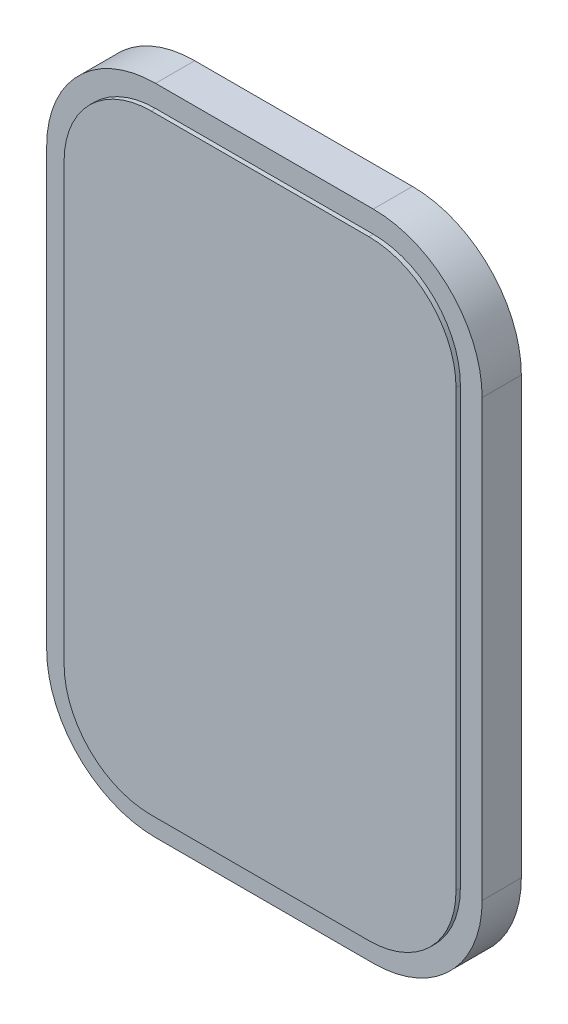
ISO-10303-21;
HEADER;
FILE_DESCRIPTION(('STEP AP214'),'2;1');
FILE_NAME('part.step','',(''),(''),'','','');
FILE_SCHEMA(('AUTOMOTIVE_DESIGN { 1 0 10303 214 1 1 1 1 }'));
ENDSEC;
DATA;
#1=APPLICATION_CONTEXT('core data for automotive mechanical design processes');
#2=APPLICATION_PROTOCOL_DEFINITION('international standard','automotive_design',2000,#1);
#3=PRODUCT_CONTEXT('',#1,'mechanical');
#4=PRODUCT('Part','Part','',(#3));
#5=PRODUCT_RELATED_PRODUCT_CATEGORY('part','',(#4));
#6=PRODUCT_DEFINITION_FORMATION('','',#4);
#7=PRODUCT_DEFINITION_CONTEXT('part definition',#1,'design');
#8=PRODUCT_DEFINITION('design','',#6,#7);
#9=PRODUCT_DEFINITION_SHAPE('','',#8);
#10=(LENGTH_UNIT() NAMED_UNIT(*) SI_UNIT(.MILLI.,.METRE.));
#11=(NAMED_UNIT(*) PLANE_ANGLE_UNIT() SI_UNIT($,.RADIAN.));
#12=(NAMED_UNIT(*) SI_UNIT($,.STERADIAN.) SOLID_ANGLE_UNIT());
#13=UNCERTAINTY_MEASURE_WITH_UNIT(LENGTH_MEASURE(1.E-05),#10,'distance_accuracy_value','');
#14=(GEOMETRIC_REPRESENTATION_CONTEXT(3) GLOBAL_UNCERTAINTY_ASSIGNED_CONTEXT((#13)) GLOBAL_UNIT_ASSIGNED_CONTEXT((#10,
#11,#12)) REPRESENTATION_CONTEXT('',''));
#15=CARTESIAN_POINT('',(0.,0.,0.));
#16=DIRECTION('',(0.,0.,1.));
#17=DIRECTION('',(1.,0.,0.));
#18=AXIS2_PLACEMENT_3D('',#15,#16,#17);
#19=CARTESIAN_POINT('',(12.7,-19.05,2.54));
#20=DIRECTION('',(-1.,0.,0.));
#21=DIRECTION('',(0.,0.,1.));
#22=AXIS2_PLACEMENT_3D('',#19,#20,#21);
#23=PLANE('',#22);
#24=DIRECTION('',(0.,1.,0.));
#25=VECTOR('',#24,1.);
#26=CARTESIAN_POINT('',(12.7,-12.7,2.286));
#27=LINE('',#26,#25);
#28=CARTESIAN_POINT('',(12.7,-12.7,2.286));
#29=VERTEX_POINT('',#28);
#30=CARTESIAN_POINT('',(12.7,12.7,2.286));
#31=VERTEX_POINT('',#30);
#32=EDGE_CURVE('E225',#29,#31,#27,.T.);
#33=ORIENTED_EDGE('',*,*,#32,.F.);
#34=DIRECTION('',(0.,0.,-1.));
#35=VECTOR('',#34,1.);
#36=CARTESIAN_POINT('',(12.7,-12.7,2.54));
#37=LINE('',#36,#35);
#38=CARTESIAN_POINT('',(12.7,-12.7,0.));
#39=VERTEX_POINT('',#38);
#40=EDGE_CURVE('E249',#29,#39,#37,.T.);
#41=ORIENTED_EDGE('',*,*,#40,.T.);
#42=DIRECTION('',(0.,1.,0.));
#43=VECTOR('',#42,1.);
#44=CARTESIAN_POINT('',(12.7,-19.05,0.));
#45=LINE('',#44,#43);
#46=CARTESIAN_POINT('',(12.7,12.7,0.));
#47=VERTEX_POINT('',#46);
#48=EDGE_CURVE('E234',#39,#47,#45,.T.);
#49=ORIENTED_EDGE('',*,*,#48,.T.);
#50=DIRECTION('',(0.,0.,-1.));
#51=VECTOR('',#50,1.);
#52=CARTESIAN_POINT('',(12.7,12.7,2.54));
#53=LINE('',#52,#51);
#54=EDGE_CURVE('E246',#47,#31,#53,.F.);
#55=ORIENTED_EDGE('',*,*,#54,.T.);
#56=EDGE_LOOP('',(#33,#41,#49,#55));
#57=FACE_BOUND('',#56,.T.);
#58=ADVANCED_FACE('F33',(#57),#23,.F.);
#59=CARTESIAN_POINT('',(-12.7,19.05,2.54));
#60=DIRECTION('',(0.,-1.,0.));
#61=DIRECTION('',(0.,0.,-1.));
#62=AXIS2_PLACEMENT_3D('',#59,#60,#61);
#63=PLANE('',#62);
#64=DIRECTION('',(-1.,0.,0.));
#65=VECTOR('',#64,1.);
#66=CARTESIAN_POINT('',(6.35,19.05,2.286));
#67=LINE('',#66,#65);
#68=CARTESIAN_POINT('',(6.35,19.05,2.286));
#69=VERTEX_POINT('',#68);
#70=CARTESIAN_POINT('',(-6.35,19.05,2.286));
#71=VERTEX_POINT('',#70);
#72=EDGE_CURVE('E56',#69,#71,#67,.T.);
#73=ORIENTED_EDGE('',*,*,#72,.F.);
#74=DIRECTION('',(0.,0.,-1.));
#75=VECTOR('',#74,1.);
#76=CARTESIAN_POINT('',(6.35,19.05,2.54));
#77=LINE('',#76,#75);
#78=CARTESIAN_POINT('',(6.35,19.05,0.));
#79=VERTEX_POINT('',#78);
#80=EDGE_CURVE('E267',#69,#79,#77,.T.);
#81=ORIENTED_EDGE('',*,*,#80,.T.);
#82=DIRECTION('',(-1.,0.,0.));
#83=VECTOR('',#82,1.);
#84=CARTESIAN_POINT('',(-12.7,19.05,0.));
#85=LINE('',#84,#83);
#86=CARTESIAN_POINT('',(-6.35,19.05,0.));
#87=VERTEX_POINT('',#86);
#88=EDGE_CURVE('E237',#79,#87,#85,.T.);
#89=ORIENTED_EDGE('',*,*,#88,.T.);
#90=DIRECTION('',(0.,0.,-1.));
#91=VECTOR('',#90,1.);
#92=CARTESIAN_POINT('',(-6.35,19.05,2.54));
#93=LINE('',#92,#91);
#94=EDGE_CURVE('E264',#87,#71,#93,.F.);
#95=ORIENTED_EDGE('',*,*,#94,.T.);
#96=EDGE_LOOP('',(#73,#81,#89,#95));
#97=FACE_BOUND('',#96,.T.);
#98=ADVANCED_FACE('F305',(#97),#63,.F.);
#99=CARTESIAN_POINT('',(-12.7,-19.05,2.54));
#100=DIRECTION('',(1.,0.,0.));
#101=DIRECTION('',(0.,0.,-1.));
#102=AXIS2_PLACEMENT_3D('',#99,#100,#101);
#103=PLANE('',#102);
#104=DIRECTION('',(0.,-1.,0.));
#105=VECTOR('',#104,1.);
#106=CARTESIAN_POINT('',(-12.7,12.7,2.286));
#107=LINE('',#106,#105);
#108=CARTESIAN_POINT('',(-12.7,12.7,2.286));
#109=VERTEX_POINT('',#108);
#110=CARTESIAN_POINT('',(-12.7,-12.7,2.286));
#111=VERTEX_POINT('',#110);
#112=EDGE_CURVE('E232',#109,#111,#107,.T.);
#113=ORIENTED_EDGE('',*,*,#112,.F.);
#114=DIRECTION('',(0.,0.,-1.));
#115=VECTOR('',#114,1.);
#116=CARTESIAN_POINT('',(-12.7,12.7,2.54));
#117=LINE('',#116,#115);
#118=CARTESIAN_POINT('',(-12.7,12.7,0.));
#119=VERTEX_POINT('',#118);
#120=EDGE_CURVE('E41',#109,#119,#117,.T.);
#121=ORIENTED_EDGE('',*,*,#120,.T.);
#122=DIRECTION('',(0.,-1.,0.));
#123=VECTOR('',#122,1.);
#124=CARTESIAN_POINT('',(-12.7,-19.05,0.));
#125=LINE('',#124,#123);
#126=CARTESIAN_POINT('',(-12.7,-12.7,0.));
#127=VERTEX_POINT('',#126);
#128=EDGE_CURVE('E240',#119,#127,#125,.T.);
#129=ORIENTED_EDGE('',*,*,#128,.T.);
#130=DIRECTION('',(0.,0.,-1.));
#131=VECTOR('',#130,1.);
#132=CARTESIAN_POINT('',(-12.7,-12.7,2.54));
#133=LINE('',#132,#131);
#134=EDGE_CURVE('E11',#127,#111,#133,.F.);
#135=ORIENTED_EDGE('',*,*,#134,.T.);
#136=EDGE_LOOP('',(#113,#121,#129,#135));
#137=FACE_BOUND('',#136,.T.);
#138=ADVANCED_FACE('F272',(#137),#103,.F.);
#139=CARTESIAN_POINT('',(-12.7,-19.05,2.54));
#140=DIRECTION('',(0.,1.,0.));
#141=DIRECTION('',(0.,0.,1.));
#142=AXIS2_PLACEMENT_3D('',#139,#140,#141);
#143=PLANE('',#142);
#144=DIRECTION('',(1.,0.,0.));
#145=VECTOR('',#144,1.);
#146=CARTESIAN_POINT('',(-6.35,-19.05,2.286));
#147=LINE('',#146,#145);
#148=CARTESIAN_POINT('',(-6.35,-19.05,2.286));
#149=VERTEX_POINT('',#148);
#150=CARTESIAN_POINT('',(6.35,-19.05,2.286));
#151=VERTEX_POINT('',#150);
#152=EDGE_CURVE('E221',#149,#151,#147,.T.);
#153=ORIENTED_EDGE('',*,*,#152,.F.);
#154=DIRECTION('',(0.,0.,-1.));
#155=VECTOR('',#154,1.);
#156=CARTESIAN_POINT('',(-6.35,-19.05,2.54));
#157=LINE('',#156,#155);
#158=CARTESIAN_POINT('',(-6.35,-19.05,0.));
#159=VERTEX_POINT('',#158);
#160=EDGE_CURVE('E259',#149,#159,#157,.T.);
#161=ORIENTED_EDGE('',*,*,#160,.T.);
#162=DIRECTION('',(1.,0.,0.));
#163=VECTOR('',#162,1.);
#164=CARTESIAN_POINT('',(-12.7,-19.05,0.));
#165=LINE('',#164,#163);
#166=CARTESIAN_POINT('',(6.35,-19.05,0.));
#167=VERTEX_POINT('',#166);
#168=EDGE_CURVE('E243',#159,#167,#165,.T.);
#169=ORIENTED_EDGE('',*,*,#168,.T.);
#170=DIRECTION('',(0.,0.,-1.));
#171=VECTOR('',#170,1.);
#172=CARTESIAN_POINT('',(6.35,-19.05,2.54));
#173=LINE('',#172,#171);
#174=EDGE_CURVE('E261',#167,#151,#173,.F.);
#175=ORIENTED_EDGE('',*,*,#174,.T.);
#176=EDGE_LOOP('',(#153,#161,#169,#175));
#177=FACE_BOUND('',#176,.T.);
#178=ADVANCED_FACE('F290',(#177),#143,.F.);
#179=CARTESIAN_POINT('',(6.35,-12.7,2.54));
#180=DIRECTION('',(0.,0.,-1.));
#181=DIRECTION('',(-1.,0.,0.));
#182=AXIS2_PLACEMENT_3D('',#179,#180,#181);
#183=CYLINDRICAL_SURFACE('',#182,6.35);
#184=ORIENTED_EDGE('',*,*,#40,.F.);
#185=CARTESIAN_POINT('',(6.35,-12.7,2.286));
#186=DIRECTION('',(0.,0.,1.));
#187=DIRECTION('',(1.,0.,0.));
#188=AXIS2_PLACEMENT_3D('',#185,#186,#187);
#189=CIRCLE('',#188,6.35);
#190=EDGE_CURVE('E223',#151,#29,#189,.T.);
#191=ORIENTED_EDGE('',*,*,#190,.F.);
#192=ORIENTED_EDGE('',*,*,#174,.F.);
#193=CARTESIAN_POINT('',(6.35,-12.7,0.));
#194=DIRECTION('',(0.,0.,-1.));
#195=DIRECTION('',(-1.,0.,0.));
#196=AXIS2_PLACEMENT_3D('',#193,#194,#195);
#197=CIRCLE('',#196,6.35);
#198=EDGE_CURVE('E257',#39,#167,#197,.T.);
#199=ORIENTED_EDGE('',*,*,#198,.F.);
#200=EDGE_LOOP('',(#184,#191,#192,#199));
#201=FACE_BOUND('',#200,.T.);
#202=ADVANCED_FACE('F295',(#201),#183,.T.);
#203=CARTESIAN_POINT('',(6.35,12.7,2.54));
#204=DIRECTION('',(0.,0.,-1.));
#205=DIRECTION('',(-1.,0.,0.));
#206=AXIS2_PLACEMENT_3D('',#203,#204,#205);
#207=CYLINDRICAL_SURFACE('',#206,6.35);
#208=ORIENTED_EDGE('',*,*,#80,.F.);
#209=CARTESIAN_POINT('',(6.35,12.7,2.286));
#210=DIRECTION('',(0.,0.,1.));
#211=DIRECTION('',(1.,0.,0.));
#212=AXIS2_PLACEMENT_3D('',#209,#210,#211);
#213=CIRCLE('',#212,6.35);
#214=EDGE_CURVE('E227',#31,#69,#213,.T.);
#215=ORIENTED_EDGE('',*,*,#214,.F.);
#216=ORIENTED_EDGE('',*,*,#54,.F.);
#217=CARTESIAN_POINT('',(6.35,12.7,0.));
#218=DIRECTION('',(0.,0.,-1.));
#219=DIRECTION('',(-1.,0.,0.));
#220=AXIS2_PLACEMENT_3D('',#217,#218,#219);
#221=CIRCLE('',#220,6.35);
#222=EDGE_CURVE('E255',#79,#47,#221,.T.);
#223=ORIENTED_EDGE('',*,*,#222,.F.);
#224=EDGE_LOOP('',(#208,#215,#216,#223));
#225=FACE_BOUND('',#224,.T.);
#226=ADVANCED_FACE('F303',(#225),#207,.T.);
#227=CARTESIAN_POINT('',(-6.35,-12.7,2.54));
#228=DIRECTION('',(0.,0.,-1.));
#229=DIRECTION('',(-1.,0.,0.));
#230=AXIS2_PLACEMENT_3D('',#227,#228,#229);
#231=CYLINDRICAL_SURFACE('',#230,6.35);
#232=ORIENTED_EDGE('',*,*,#160,.F.);
#233=CARTESIAN_POINT('',(-6.35,-12.7,2.286));
#234=DIRECTION('',(0.,0.,1.));
#235=DIRECTION('',(1.,0.,0.));
#236=AXIS2_PLACEMENT_3D('',#233,#234,#235);
#237=CIRCLE('',#236,6.35);
#238=EDGE_CURVE('E208',#111,#149,#237,.T.);
#239=ORIENTED_EDGE('',*,*,#238,.F.);
#240=ORIENTED_EDGE('',*,*,#134,.F.);
#241=CARTESIAN_POINT('',(-6.35,-12.7,0.));
#242=DIRECTION('',(0.,0.,-1.));
#243=DIRECTION('',(-1.,0.,0.));
#244=AXIS2_PLACEMENT_3D('',#241,#242,#243);
#245=CIRCLE('',#244,6.35);
#246=EDGE_CURVE('E253',#159,#127,#245,.T.);
#247=ORIENTED_EDGE('',*,*,#246,.F.);
#248=EDGE_LOOP('',(#232,#239,#240,#247));
#249=FACE_BOUND('',#248,.T.);
#250=ADVANCED_FACE('F285',(#249),#231,.T.);
#251=CARTESIAN_POINT('',(-6.35,12.7,2.54));
#252=DIRECTION('',(0.,0.,-1.));
#253=DIRECTION('',(-1.,0.,0.));
#254=AXIS2_PLACEMENT_3D('',#251,#252,#253);
#255=CYLINDRICAL_SURFACE('',#254,6.35);
#256=ORIENTED_EDGE('',*,*,#120,.F.);
#257=CARTESIAN_POINT('',(-6.35,12.7,2.286));
#258=DIRECTION('',(0.,0.,1.));
#259=DIRECTION('',(1.,0.,0.));
#260=AXIS2_PLACEMENT_3D('',#257,#258,#259);
#261=CIRCLE('',#260,6.35);
#262=EDGE_CURVE('E230',#71,#109,#261,.T.);
#263=ORIENTED_EDGE('',*,*,#262,.F.);
#264=ORIENTED_EDGE('',*,*,#94,.F.);
#265=CARTESIAN_POINT('',(-6.35,12.7,0.));
#266=DIRECTION('',(0.,0.,-1.));
#267=DIRECTION('',(-1.,0.,0.));
#268=AXIS2_PLACEMENT_3D('',#265,#266,#267);
#269=CIRCLE('',#268,6.35);
#270=EDGE_CURVE('E251',#119,#87,#269,.T.);
#271=ORIENTED_EDGE('',*,*,#270,.F.);
#272=EDGE_LOOP('',(#256,#263,#264,#271));
#273=FACE_BOUND('',#272,.T.);
#274=ADVANCED_FACE('F35',(#273),#255,.T.);
#275=CARTESIAN_POINT('',(0.,0.,0.));
#276=DIRECTION('',(0.,0.,-1.));
#277=DIRECTION('',(-1.,0.,0.));
#278=AXIS2_PLACEMENT_3D('',#275,#276,#277);
#279=PLANE('',#278);
#280=ORIENTED_EDGE('',*,*,#48,.F.);
#281=ORIENTED_EDGE('',*,*,#198,.T.);
#282=ORIENTED_EDGE('',*,*,#168,.F.);
#283=ORIENTED_EDGE('',*,*,#246,.T.);
#284=ORIENTED_EDGE('',*,*,#128,.F.);
#285=ORIENTED_EDGE('',*,*,#270,.T.);
#286=ORIENTED_EDGE('',*,*,#88,.F.);
#287=ORIENTED_EDGE('',*,*,#222,.T.);
#288=EDGE_LOOP('',(#280,#281,#282,#283,#284,#285,#286,#287));
#289=FACE_BOUND('',#288,.T.);
#290=ADVANCED_FACE('F280',(#289),#279,.T.);
#291=CARTESIAN_POINT('',(-6.35,-12.7,2.286));
#292=DIRECTION('',(0.,0.,1.));
#293=DIRECTION('',(1.,0.,0.));
#294=AXIS2_PLACEMENT_3D('',#291,#292,#293);
#295=PLANE('',#294);
#296=DIRECTION('',(-1.,0.,0.));
#297=VECTOR('',#296,1.);
#298=CARTESIAN_POINT('',(6.35,17.78,2.286));
#299=LINE('',#298,#297);
#300=CARTESIAN_POINT('',(6.35,17.78,2.286));
#301=VERTEX_POINT('',#300);
#302=CARTESIAN_POINT('',(-6.35,17.78,2.286));
#303=VERTEX_POINT('',#302);
#304=EDGE_CURVE('E158',#301,#303,#299,.T.);
#305=ORIENTED_EDGE('',*,*,#304,.F.);
#306=CARTESIAN_POINT('',(6.35,12.7,2.286));
#307=DIRECTION('',(0.,0.,1.));
#308=DIRECTION('',(1.,0.,0.));
#309=AXIS2_PLACEMENT_3D('',#306,#307,#308);
#310=CIRCLE('',#309,5.08);
#311=CARTESIAN_POINT('',(11.43,12.7,2.286));
#312=VERTEX_POINT('',#311);
#313=EDGE_CURVE('E188',#312,#301,#310,.T.);
#314=ORIENTED_EDGE('',*,*,#313,.F.);
#315=DIRECTION('',(0.,1.,0.));
#316=VECTOR('',#315,1.);
#317=CARTESIAN_POINT('',(11.43,-12.7,2.286));
#318=LINE('',#317,#316);
#319=CARTESIAN_POINT('',(11.43,-12.7,2.286));
#320=VERTEX_POINT('',#319);
#321=EDGE_CURVE('E185',#320,#312,#318,.T.);
#322=ORIENTED_EDGE('',*,*,#321,.F.);
#323=CARTESIAN_POINT('',(6.35,-12.7,2.286));
#324=DIRECTION('',(0.,0.,1.));
#325=DIRECTION('',(1.,0.,0.));
#326=AXIS2_PLACEMENT_3D('',#323,#324,#325);
#327=CIRCLE('',#326,5.08);
#328=CARTESIAN_POINT('',(6.35,-17.78,2.286));
#329=VERTEX_POINT('',#328);
#330=EDGE_CURVE('E182',#329,#320,#327,.T.);
#331=ORIENTED_EDGE('',*,*,#330,.F.);
#332=DIRECTION('',(1.,0.,0.));
#333=VECTOR('',#332,1.);
#334=CARTESIAN_POINT('',(-6.35,-17.78,2.286));
#335=LINE('',#334,#333);
#336=CARTESIAN_POINT('',(-6.35,-17.78,2.286));
#337=VERTEX_POINT('',#336);
#338=EDGE_CURVE('E179',#337,#329,#335,.T.);
#339=ORIENTED_EDGE('',*,*,#338,.F.);
#340=CARTESIAN_POINT('',(-6.35,-12.7,2.286));
#341=DIRECTION('',(0.,0.,1.));
#342=DIRECTION('',(1.,0.,0.));
#343=AXIS2_PLACEMENT_3D('',#340,#341,#342);
#344=CIRCLE('',#343,5.08);
#345=CARTESIAN_POINT('',(-11.43,-12.7,2.286));
#346=VERTEX_POINT('',#345);
#347=EDGE_CURVE('E168',#346,#337,#344,.T.);
#348=ORIENTED_EDGE('',*,*,#347,.F.);
#349=DIRECTION('',(0.,-1.,0.));
#350=VECTOR('',#349,1.);
#351=CARTESIAN_POINT('',(-11.43,12.7,2.286));
#352=LINE('',#351,#350);
#353=CARTESIAN_POINT('',(-11.43,12.7,2.286));
#354=VERTEX_POINT('',#353);
#355=EDGE_CURVE('E150',#354,#346,#352,.T.);
#356=ORIENTED_EDGE('',*,*,#355,.F.);
#357=CARTESIAN_POINT('',(-6.35,12.7,2.286));
#358=DIRECTION('',(0.,0.,1.));
#359=DIRECTION('',(1.,0.,0.));
#360=AXIS2_PLACEMENT_3D('',#357,#358,#359);
#361=CIRCLE('',#360,5.08);
#362=EDGE_CURVE('E164',#303,#354,#361,.T.);
#363=ORIENTED_EDGE('',*,*,#362,.F.);
#364=EDGE_LOOP('',(#305,#314,#322,#331,#339,#348,#356,#363));
#365=FACE_BOUND('',#364,.T.);
#366=ORIENTED_EDGE('',*,*,#238,.T.);
#367=ORIENTED_EDGE('',*,*,#152,.T.);
#368=ORIENTED_EDGE('',*,*,#190,.T.);
#369=ORIENTED_EDGE('',*,*,#32,.T.);
#370=ORIENTED_EDGE('',*,*,#214,.T.);
#371=ORIENTED_EDGE('',*,*,#72,.T.);
#372=ORIENTED_EDGE('',*,*,#262,.T.);
#373=ORIENTED_EDGE('',*,*,#112,.T.);
#374=EDGE_LOOP('',(#366,#367,#368,#369,#370,#371,#372,#373));
#375=FACE_BOUND('',#374,.T.);
#376=ADVANCED_FACE('F163',(#365,#375),#295,.T.);
#377=CARTESIAN_POINT('',(-6.35,12.7,2.286));
#378=DIRECTION('',(0.,0.,1.));
#379=DIRECTION('',(1.,0.,0.));
#380=AXIS2_PLACEMENT_3D('',#377,#378,#379);
#381=CYLINDRICAL_SURFACE('',#380,5.08);
#382=CARTESIAN_POINT('',(-6.35,12.7,2.54));
#383=DIRECTION('',(0.,0.,1.));
#384=DIRECTION('',(1.,0.,0.));
#385=AXIS2_PLACEMENT_3D('',#382,#383,#384);
#386=CIRCLE('',#385,5.08);
#387=CARTESIAN_POINT('',(-6.35,17.78,2.54));
#388=VERTEX_POINT('',#387);
#389=CARTESIAN_POINT('',(-11.43,12.7,2.54));
#390=VERTEX_POINT('',#389);
#391=EDGE_CURVE('E192',#388,#390,#386,.T.);
#392=ORIENTED_EDGE('',*,*,#391,.F.);
#393=DIRECTION('',(0.,0.,1.));
#394=VECTOR('',#393,1.);
#395=CARTESIAN_POINT('',(-6.35,17.78,2.286));
#396=LINE('',#395,#394);
#397=EDGE_CURVE('E171',#303,#388,#396,.T.);
#398=ORIENTED_EDGE('',*,*,#397,.F.);
#399=ORIENTED_EDGE('',*,*,#362,.T.);
#400=DIRECTION('',(0.,0.,1.));
#401=VECTOR('',#400,1.);
#402=CARTESIAN_POINT('',(-11.43,12.7,2.286));
#403=LINE('',#402,#401);
#404=EDGE_CURVE('E147',#354,#390,#403,.T.);
#405=ORIENTED_EDGE('',*,*,#404,.T.);
#406=EDGE_LOOP('',(#392,#398,#399,#405));
#407=FACE_BOUND('',#406,.T.);
#408=ADVANCED_FACE('F170',(#407),#381,.T.);
#409=CARTESIAN_POINT('',(6.35,17.78,2.286));
#410=DIRECTION('',(0.,1.,0.));
#411=DIRECTION('',(0.,0.,1.));
#412=AXIS2_PLACEMENT_3D('',#409,#410,#411);
#413=PLANE('',#412);
#414=DIRECTION('',(-1.,0.,0.));
#415=VECTOR('',#414,1.);
#416=CARTESIAN_POINT('',(6.35,17.78,2.54));
#417=LINE('',#416,#415);
#418=CARTESIAN_POINT('',(6.35,17.78,2.54));
#419=VERTEX_POINT('',#418);
#420=EDGE_CURVE('E172',#419,#388,#417,.T.);
#421=ORIENTED_EDGE('',*,*,#420,.F.);
#422=DIRECTION('',(0.,0.,1.));
#423=VECTOR('',#422,1.);
#424=CARTESIAN_POINT('',(6.35,17.78,2.286));
#425=LINE('',#424,#423);
#426=EDGE_CURVE('E209',#301,#419,#425,.T.);
#427=ORIENTED_EDGE('',*,*,#426,.F.);
#428=ORIENTED_EDGE('',*,*,#304,.T.);
#429=ORIENTED_EDGE('',*,*,#397,.T.);
#430=EDGE_LOOP('',(#421,#427,#428,#429));
#431=FACE_BOUND('',#430,.T.);
#432=ADVANCED_FACE('F371',(#431),#413,.T.);
#433=CARTESIAN_POINT('',(6.35,12.7,2.286));
#434=DIRECTION('',(0.,0.,1.));
#435=DIRECTION('',(1.,0.,0.));
#436=AXIS2_PLACEMENT_3D('',#433,#434,#435);
#437=CYLINDRICAL_SURFACE('',#436,5.08);
#438=CARTESIAN_POINT('',(6.35,12.7,2.54));
#439=DIRECTION('',(0.,0.,1.));
#440=DIRECTION('',(1.,0.,0.));
#441=AXIS2_PLACEMENT_3D('',#438,#439,#440);
#442=CIRCLE('',#441,5.08);
#443=CARTESIAN_POINT('',(11.43,12.7,2.54));
#444=VERTEX_POINT('',#443);
#445=EDGE_CURVE('E175',#444,#419,#442,.T.);
#446=ORIENTED_EDGE('',*,*,#445,.F.);
#447=DIRECTION('',(0.,0.,1.));
#448=VECTOR('',#447,1.);
#449=CARTESIAN_POINT('',(11.43,12.7,2.286));
#450=LINE('',#449,#448);
#451=EDGE_CURVE('E211',#312,#444,#450,.T.);
#452=ORIENTED_EDGE('',*,*,#451,.F.);
#453=ORIENTED_EDGE('',*,*,#313,.T.);
#454=ORIENTED_EDGE('',*,*,#426,.T.);
#455=EDGE_LOOP('',(#446,#452,#453,#454));
#456=FACE_BOUND('',#455,.T.);
#457=ADVANCED_FACE('F380',(#456),#437,.T.);
#458=CARTESIAN_POINT('',(11.43,-12.7,2.286));
#459=DIRECTION('',(1.,0.,0.));
#460=DIRECTION('',(0.,0.,-1.));
#461=AXIS2_PLACEMENT_3D('',#458,#459,#460);
#462=PLANE('',#461);
#463=DIRECTION('',(0.,1.,0.));
#464=VECTOR('',#463,1.);
#465=CARTESIAN_POINT('',(11.43,-12.7,2.54));
#466=LINE('',#465,#464);
#467=CARTESIAN_POINT('',(11.43,-12.7,2.54));
#468=VERTEX_POINT('',#467);
#469=EDGE_CURVE('E202',#468,#444,#466,.T.);
#470=ORIENTED_EDGE('',*,*,#469,.F.);
#471=DIRECTION('',(0.,0.,1.));
#472=VECTOR('',#471,1.);
#473=CARTESIAN_POINT('',(11.43,-12.7,2.286));
#474=LINE('',#473,#472);
#475=EDGE_CURVE('E213',#320,#468,#474,.T.);
#476=ORIENTED_EDGE('',*,*,#475,.F.);
#477=ORIENTED_EDGE('',*,*,#321,.T.);
#478=ORIENTED_EDGE('',*,*,#451,.T.);
#479=EDGE_LOOP('',(#470,#476,#477,#478));
#480=FACE_BOUND('',#479,.T.);
#481=ADVANCED_FACE('F390',(#480),#462,.T.);
#482=CARTESIAN_POINT('',(6.35,-12.7,2.286));
#483=DIRECTION('',(0.,0.,1.));
#484=DIRECTION('',(1.,0.,0.));
#485=AXIS2_PLACEMENT_3D('',#482,#483,#484);
#486=CYLINDRICAL_SURFACE('',#485,5.08);
#487=CARTESIAN_POINT('',(6.35,-12.7,2.54));
#488=DIRECTION('',(0.,0.,1.));
#489=DIRECTION('',(1.,0.,0.));
#490=AXIS2_PLACEMENT_3D('',#487,#488,#489);
#491=CIRCLE('',#490,5.08);
#492=CARTESIAN_POINT('',(6.35,-17.78,2.54));
#493=VERTEX_POINT('',#492);
#494=EDGE_CURVE('E199',#493,#468,#491,.T.);
#495=ORIENTED_EDGE('',*,*,#494,.F.);
#496=DIRECTION('',(0.,0.,1.));
#497=VECTOR('',#496,1.);
#498=CARTESIAN_POINT('',(6.35,-17.78,2.286));
#499=LINE('',#498,#497);
#500=EDGE_CURVE('E215',#329,#493,#499,.T.);
#501=ORIENTED_EDGE('',*,*,#500,.F.);
#502=ORIENTED_EDGE('',*,*,#330,.T.);
#503=ORIENTED_EDGE('',*,*,#475,.T.);
#504=EDGE_LOOP('',(#495,#501,#502,#503));
#505=FACE_BOUND('',#504,.T.);
#506=ADVANCED_FACE('F400',(#505),#486,.T.);
#507=CARTESIAN_POINT('',(-6.35,-17.78,2.286));
#508=DIRECTION('',(0.,-1.,0.));
#509=DIRECTION('',(0.,0.,-1.));
#510=AXIS2_PLACEMENT_3D('',#507,#508,#509);
#511=PLANE('',#510);
#512=DIRECTION('',(1.,0.,0.));
#513=VECTOR('',#512,1.);
#514=CARTESIAN_POINT('',(-6.35,-17.78,2.54));
#515=LINE('',#514,#513);
#516=CARTESIAN_POINT('',(-6.35,-17.78,2.54));
#517=VERTEX_POINT('',#516);
#518=EDGE_CURVE('E196',#517,#493,#515,.T.);
#519=ORIENTED_EDGE('',*,*,#518,.F.);
#520=DIRECTION('',(0.,0.,1.));
#521=VECTOR('',#520,1.);
#522=CARTESIAN_POINT('',(-6.35,-17.78,2.286));
#523=LINE('',#522,#521);
#524=EDGE_CURVE('E217',#337,#517,#523,.T.);
#525=ORIENTED_EDGE('',*,*,#524,.F.);
#526=ORIENTED_EDGE('',*,*,#338,.T.);
#527=ORIENTED_EDGE('',*,*,#500,.T.);
#528=EDGE_LOOP('',(#519,#525,#526,#527));
#529=FACE_BOUND('',#528,.T.);
#530=ADVANCED_FACE('F410',(#529),#511,.T.);
#531=CARTESIAN_POINT('',(-6.35,-12.7,2.286));
#532=DIRECTION('',(0.,0.,1.));
#533=DIRECTION('',(1.,0.,0.));
#534=AXIS2_PLACEMENT_3D('',#531,#532,#533);
#535=CYLINDRICAL_SURFACE('',#534,5.08);
#536=CARTESIAN_POINT('',(-6.35,-12.7,2.54));
#537=DIRECTION('',(0.,0.,1.));
#538=DIRECTION('',(1.,0.,0.));
#539=AXIS2_PLACEMENT_3D('',#536,#537,#538);
#540=CIRCLE('',#539,5.08);
#541=CARTESIAN_POINT('',(-11.43,-12.7,2.54));
#542=VERTEX_POINT('',#541);
#543=EDGE_CURVE('E48',#542,#517,#540,.T.);
#544=ORIENTED_EDGE('',*,*,#543,.F.);
#545=DIRECTION('',(0.,0.,1.));
#546=VECTOR('',#545,1.);
#547=CARTESIAN_POINT('',(-11.43,-12.7,2.286));
#548=LINE('',#547,#546);
#549=EDGE_CURVE('E157',#346,#542,#548,.T.);
#550=ORIENTED_EDGE('',*,*,#549,.F.);
#551=ORIENTED_EDGE('',*,*,#347,.T.);
#552=ORIENTED_EDGE('',*,*,#524,.T.);
#553=EDGE_LOOP('',(#544,#550,#551,#552));
#554=FACE_BOUND('',#553,.T.);
#555=ADVANCED_FACE('F420',(#554),#535,.T.);
#556=CARTESIAN_POINT('',(-11.43,12.7,2.286));
#557=DIRECTION('',(-1.,0.,0.));
#558=DIRECTION('',(0.,-1.,0.));
#559=AXIS2_PLACEMENT_3D('',#556,#557,#558);
#560=PLANE('',#559);
#561=DIRECTION('',(0.,-1.,0.));
#562=VECTOR('',#561,1.);
#563=CARTESIAN_POINT('',(-11.43,12.7,2.54));
#564=LINE('',#563,#562);
#565=EDGE_CURVE('E152',#390,#542,#564,.T.);
#566=ORIENTED_EDGE('',*,*,#565,.F.);
#567=ORIENTED_EDGE('',*,*,#404,.F.);
#568=ORIENTED_EDGE('',*,*,#355,.T.);
#569=ORIENTED_EDGE('',*,*,#549,.T.);
#570=EDGE_LOOP('',(#566,#567,#568,#569));
#571=FACE_BOUND('',#570,.T.);
#572=ADVANCED_FACE('F149',(#571),#560,.T.);
#573=CARTESIAN_POINT('',(0.,0.,2.54));
#574=DIRECTION('',(0.,0.,-1.));
#575=DIRECTION('',(-1.,0.,0.));
#576=AXIS2_PLACEMENT_3D('',#573,#574,#575);
#577=PLANE('',#576);
#578=ORIENTED_EDGE('',*,*,#391,.T.);
#579=ORIENTED_EDGE('',*,*,#565,.T.);
#580=ORIENTED_EDGE('',*,*,#543,.T.);
#581=ORIENTED_EDGE('',*,*,#518,.T.);
#582=ORIENTED_EDGE('',*,*,#494,.T.);
#583=ORIENTED_EDGE('',*,*,#469,.T.);
#584=ORIENTED_EDGE('',*,*,#445,.T.);
#585=ORIENTED_EDGE('',*,*,#420,.T.);
#586=EDGE_LOOP('',(#578,#579,#580,#581,#582,#583,#584,#585));
#587=FACE_BOUND('',#586,.T.);
#588=ADVANCED_FACE('F332',(#587),#577,.F.);
#589=CLOSED_SHELL('',(#58,#98,#138,#178,#202,#226,#250,#274,#290,#376,#408,#432,#457,#481,#506,
#530,#555,#572,#588));
#590=MANIFOLD_SOLID_BREP('B2',#589);
#591=ADVANCED_BREP_SHAPE_REPRESENTATION('',(#18,#590),#14);
#592=SHAPE_DEFINITION_REPRESENTATION(#9,#591);
ENDSEC;
END-ISO-10303-21;
